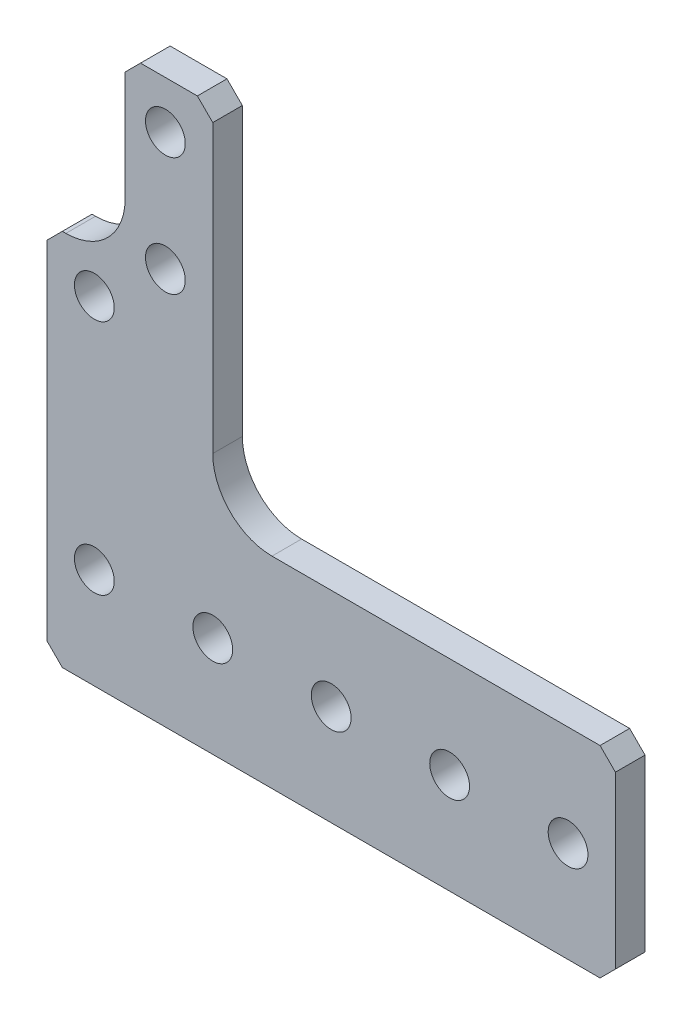
ISO-10303-21;
HEADER;
FILE_DESCRIPTION(('STEP AP214'),'2;1');
FILE_NAME('part.step','',(''),(''),'','','');
FILE_SCHEMA(('AUTOMOTIVE_DESIGN { 1 0 10303 214 1 1 1 1 }'));
ENDSEC;
DATA;
#1=APPLICATION_CONTEXT('core data for automotive mechanical design processes');
#2=APPLICATION_PROTOCOL_DEFINITION('international standard','automotive_design',2000,#1);
#3=PRODUCT_CONTEXT('',#1,'mechanical');
#4=PRODUCT('Part','Part','',(#3));
#5=PRODUCT_RELATED_PRODUCT_CATEGORY('part','',(#4));
#6=PRODUCT_DEFINITION_FORMATION('','',#4);
#7=PRODUCT_DEFINITION_CONTEXT('part definition',#1,'design');
#8=PRODUCT_DEFINITION('design','',#6,#7);
#9=PRODUCT_DEFINITION_SHAPE('','',#8);
#10=(LENGTH_UNIT() NAMED_UNIT(*) SI_UNIT(.MILLI.,.METRE.));
#11=(NAMED_UNIT(*) PLANE_ANGLE_UNIT() SI_UNIT($,.RADIAN.));
#12=(NAMED_UNIT(*) SI_UNIT($,.STERADIAN.) SOLID_ANGLE_UNIT());
#13=UNCERTAINTY_MEASURE_WITH_UNIT(LENGTH_MEASURE(1.E-05),#10,'distance_accuracy_value','');
#14=(GEOMETRIC_REPRESENTATION_CONTEXT(3) GLOBAL_UNCERTAINTY_ASSIGNED_CONTEXT((#13)) GLOBAL_UNIT_ASSIGNED_CONTEXT((#10,
#11,#12)) REPRESENTATION_CONTEXT('',''));
#15=CARTESIAN_POINT('',(0.,0.,0.));
#16=DIRECTION('',(0.,0.,1.));
#17=DIRECTION('',(1.,0.,0.));
#18=AXIS2_PLACEMENT_3D('',#15,#16,#17);
#19=CARTESIAN_POINT('',(-5.08,29.718,3.175));
#20=DIRECTION('',(0.,-1.,0.));
#21=DIRECTION('',(1.,0.,0.));
#22=AXIS2_PLACEMENT_3D('',#19,#20,#21);
#23=PLANE('',#22);
#24=DIRECTION('',(0.,0.,1.));
#25=VECTOR('',#24,1.);
#26=CARTESIAN_POINT('',(-3.42899999999999,29.718,3.175));
#27=LINE('',#26,#25);
#28=CARTESIAN_POINT('',(-3.42899999999999,29.718,0.));
#29=VERTEX_POINT('',#28);
#30=CARTESIAN_POINT('',(-3.42899999999999,29.718,3.175));
#31=VERTEX_POINT('',#30);
#32=EDGE_CURVE('E158',#29,#31,#27,.T.);
#33=ORIENTED_EDGE('',*,*,#32,.T.);
#34=DIRECTION('',(1.,0.,0.));
#35=VECTOR('',#34,1.);
#36=CARTESIAN_POINT('',(-5.08,29.718,3.175));
#37=LINE('',#36,#35);
#38=CARTESIAN_POINT('',(-3.04800000000001,29.718,3.175));
#39=VERTEX_POINT('',#38);
#40=EDGE_CURVE('E161',#39,#31,#37,.F.);
#41=ORIENTED_EDGE('',*,*,#40,.F.);
#42=DIRECTION('',(0.,0.,1.));
#43=VECTOR('',#42,1.);
#44=CARTESIAN_POINT('',(-3.04800000000001,29.718,3.175));
#45=LINE('',#44,#43);
#46=CARTESIAN_POINT('',(-3.048,29.718,0.));
#47=VERTEX_POINT('',#46);
#48=EDGE_CURVE('E140',#39,#47,#45,.F.);
#49=ORIENTED_EDGE('',*,*,#48,.T.);
#50=DIRECTION('',(-1.,0.,0.));
#51=VECTOR('',#50,1.);
#52=CARTESIAN_POINT('',(0.,29.718,0.));
#53=LINE('',#52,#51);
#54=EDGE_CURVE('E128',#29,#47,#53,.F.);
#55=ORIENTED_EDGE('',*,*,#54,.F.);
#56=EDGE_LOOP('',(#33,#41,#49,#55));
#57=FACE_BOUND('',#56,.T.);
#58=ADVANCED_FACE('F17',(#57),#23,.F.);
#59=CARTESIAN_POINT('',(0.,0.,0.));
#60=DIRECTION('',(0.,0.,-1.));
#61=DIRECTION('',(-1.,0.,0.));
#62=AXIS2_PLACEMENT_3D('',#59,#60,#61);
#63=PLANE('',#62);
#64=CARTESIAN_POINT('',(50.8,0.,0.));
#65=DIRECTION('',(0.,0.,-1.));
#66=DIRECTION('',(-1.,0.,0.));
#67=AXIS2_PLACEMENT_3D('',#64,#65,#66);
#68=CIRCLE('',#67,2.1336);
#69=CARTESIAN_POINT('',(48.6664,0.,0.));
#70=VERTEX_POINT('',#69);
#71=EDGE_CURVE('E210',#70,#70,#68,.F.);
#72=ORIENTED_EDGE('',*,*,#71,.T.);
#73=EDGE_LOOP('',(#72));
#74=FACE_BOUND('',#73,.T.);
#75=CARTESIAN_POINT('',(25.4,0.,0.));
#76=DIRECTION('',(0.,0.,-1.));
#77=DIRECTION('',(-1.,0.,0.));
#78=AXIS2_PLACEMENT_3D('',#75,#76,#77);
#79=CIRCLE('',#78,2.1336);
#80=CARTESIAN_POINT('',(23.2664,0.,0.));
#81=VERTEX_POINT('',#80);
#82=EDGE_CURVE('E246',#81,#81,#79,.F.);
#83=ORIENTED_EDGE('',*,*,#82,.T.);
#84=EDGE_LOOP('',(#83));
#85=FACE_BOUND('',#84,.T.);
#86=CARTESIAN_POINT('',(7.62,44.45,0.));
#87=DIRECTION('',(0.,0.,-1.));
#88=DIRECTION('',(-1.,0.,0.));
#89=AXIS2_PLACEMENT_3D('',#86,#87,#88);
#90=CIRCLE('',#89,2.1336);
#91=CARTESIAN_POINT('',(5.48639999999999,44.45,0.));
#92=VERTEX_POINT('',#91);
#93=EDGE_CURVE('E252',#92,#92,#90,.F.);
#94=ORIENTED_EDGE('',*,*,#93,.T.);
#95=EDGE_LOOP('',(#94));
#96=FACE_BOUND('',#95,.T.);
#97=CARTESIAN_POINT('',(0.,25.4,0.));
#98=DIRECTION('',(0.,0.,-1.));
#99=DIRECTION('',(-1.,0.,0.));
#100=AXIS2_PLACEMENT_3D('',#97,#98,#99);
#101=CIRCLE('',#100,2.1336);
#102=CARTESIAN_POINT('',(-2.1336,25.4,0.));
#103=VERTEX_POINT('',#102);
#104=EDGE_CURVE('E258',#103,#103,#101,.F.);
#105=ORIENTED_EDGE('',*,*,#104,.T.);
#106=EDGE_LOOP('',(#105));
#107=FACE_BOUND('',#106,.T.);
#108=DIRECTION('',(0.,1.,0.));
#109=VECTOR('',#108,1.);
#110=CARTESIAN_POINT('',(55.88,-10.795,0.));
#111=LINE('',#110,#109);
#112=CARTESIAN_POINT('',(55.88,9.144,0.));
#113=VERTEX_POINT('',#112);
#114=CARTESIAN_POINT('',(55.88,-9.144,0.));
#115=VERTEX_POINT('',#114);
#116=EDGE_CURVE('E334',#113,#115,#111,.F.);
#117=ORIENTED_EDGE('',*,*,#116,.T.);
#118=DIRECTION('',(-0.707106781186548,-0.707106781186548,0.));
#119=VECTOR('',#118,1.);
#120=CARTESIAN_POINT('',(55.88,-9.144,0.));
#121=LINE('',#120,#119);
#122=CARTESIAN_POINT('',(54.229,-10.795,0.));
#123=VERTEX_POINT('',#122);
#124=EDGE_CURVE('E329',#115,#123,#121,.T.);
#125=ORIENTED_EDGE('',*,*,#124,.T.);
#126=DIRECTION('',(1.,0.,0.));
#127=VECTOR('',#126,1.);
#128=CARTESIAN_POINT('',(-5.08,-10.795,0.));
#129=LINE('',#128,#127);
#130=CARTESIAN_POINT('',(-3.429,-10.795,0.));
#131=VERTEX_POINT('',#130);
#132=EDGE_CURVE('E324',#123,#131,#129,.F.);
#133=ORIENTED_EDGE('',*,*,#132,.T.);
#134=DIRECTION('',(-0.707106781186546,0.707106781186549,0.));
#135=VECTOR('',#134,1.);
#136=CARTESIAN_POINT('',(-3.429,-10.795,0.));
#137=LINE('',#136,#135);
#138=CARTESIAN_POINT('',(-5.08,-9.14399999999999,0.));
#139=VERTEX_POINT('',#138);
#140=EDGE_CURVE('E319',#131,#139,#137,.T.);
#141=ORIENTED_EDGE('',*,*,#140,.T.);
#142=DIRECTION('',(0.,1.,0.));
#143=VECTOR('',#142,1.);
#144=CARTESIAN_POINT('',(-5.08,-10.795,0.));
#145=LINE('',#144,#143);
#146=CARTESIAN_POINT('',(-5.08,28.067,0.));
#147=VERTEX_POINT('',#146);
#148=EDGE_CURVE('E263',#139,#147,#145,.T.);
#149=ORIENTED_EDGE('',*,*,#148,.T.);
#150=DIRECTION('',(0.707106781186549,0.707106781186546,0.));
#151=VECTOR('',#150,1.);
#152=CARTESIAN_POINT('',(-5.08,28.067,0.));
#153=LINE('',#152,#151);
#154=EDGE_CURVE('E160',#147,#29,#153,.T.);
#155=ORIENTED_EDGE('',*,*,#154,.T.);
#156=ORIENTED_EDGE('',*,*,#54,.T.);
#157=CARTESIAN_POINT('',(-3.048,36.068,0.));
#158=DIRECTION('',(0.,0.,1.));
#159=DIRECTION('',(1.,0.,0.));
#160=AXIS2_PLACEMENT_3D('',#157,#158,#159);
#161=CIRCLE('',#160,6.35);
#162=CARTESIAN_POINT('',(3.302,36.068,0.));
#163=VERTEX_POINT('',#162);
#164=EDGE_CURVE('E20',#47,#163,#161,.T.);
#165=ORIENTED_EDGE('',*,*,#164,.T.);
#166=DIRECTION('',(0.,1.,0.));
#167=VECTOR('',#166,1.);
#168=CARTESIAN_POINT('',(3.302,29.718,0.));
#169=LINE('',#168,#167);
#170=CARTESIAN_POINT('',(3.302,47.879,0.));
#171=VERTEX_POINT('',#170);
#172=EDGE_CURVE('E133',#163,#171,#169,.T.);
#173=ORIENTED_EDGE('',*,*,#172,.T.);
#174=DIRECTION('',(0.707106781186549,0.707106781186546,0.));
#175=VECTOR('',#174,1.);
#176=CARTESIAN_POINT('',(3.302,47.879,0.));
#177=LINE('',#176,#175);
#178=CARTESIAN_POINT('',(4.953,49.53,0.));
#179=VERTEX_POINT('',#178);
#180=EDGE_CURVE('E191',#171,#179,#177,.T.);
#181=ORIENTED_EDGE('',*,*,#180,.T.);
#182=DIRECTION('',(1.,0.,0.));
#183=VECTOR('',#182,1.);
#184=CARTESIAN_POINT('',(3.302,49.53,0.));
#185=LINE('',#184,#183);
#186=CARTESIAN_POINT('',(11.049,49.53,0.));
#187=VERTEX_POINT('',#186);
#188=EDGE_CURVE('E186',#179,#187,#185,.T.);
#189=ORIENTED_EDGE('',*,*,#188,.T.);
#190=DIRECTION('',(0.707106781186548,-0.707106781186548,0.));
#191=VECTOR('',#190,1.);
#192=CARTESIAN_POINT('',(11.049,49.53,0.));
#193=LINE('',#192,#191);
#194=CARTESIAN_POINT('',(12.7,47.879,0.));
#195=VERTEX_POINT('',#194);
#196=EDGE_CURVE('E181',#187,#195,#193,.T.);
#197=ORIENTED_EDGE('',*,*,#196,.T.);
#198=DIRECTION('',(0.,-1.,0.));
#199=VECTOR('',#198,1.);
#200=CARTESIAN_POINT('',(12.7,49.53,0.));
#201=LINE('',#200,#199);
#202=CARTESIAN_POINT('',(12.7,17.145,0.));
#203=VERTEX_POINT('',#202);
#204=EDGE_CURVE('E175',#195,#203,#201,.T.);
#205=ORIENTED_EDGE('',*,*,#204,.T.);
#206=CARTESIAN_POINT('',(19.05,17.145,0.));
#207=DIRECTION('',(0.,0.,1.));
#208=DIRECTION('',(1.,0.,0.));
#209=AXIS2_PLACEMENT_3D('',#206,#207,#208);
#210=CIRCLE('',#209,6.35);
#211=CARTESIAN_POINT('',(19.05,10.795,0.));
#212=VERTEX_POINT('',#211);
#213=EDGE_CURVE('E264',#203,#212,#210,.T.);
#214=ORIENTED_EDGE('',*,*,#213,.T.);
#215=DIRECTION('',(1.,0.,0.));
#216=VECTOR('',#215,1.);
#217=CARTESIAN_POINT('',(12.7,10.795,0.));
#218=LINE('',#217,#216);
#219=CARTESIAN_POINT('',(54.229,10.795,0.));
#220=VERTEX_POINT('',#219);
#221=EDGE_CURVE('E164',#212,#220,#218,.T.);
#222=ORIENTED_EDGE('',*,*,#221,.T.);
#223=DIRECTION('',(0.707106781186546,-0.707106781186549,0.));
#224=VECTOR('',#223,1.);
#225=CARTESIAN_POINT('',(54.229,10.795,0.));
#226=LINE('',#225,#224);
#227=EDGE_CURVE('E170',#220,#113,#226,.T.);
#228=ORIENTED_EDGE('',*,*,#227,.T.);
#229=EDGE_LOOP('',(#117,#125,#133,#141,#149,#155,#156,#165,#173,#181,#189,#197,#205,#214,#222,#228));
#230=FACE_BOUND('',#229,.T.);
#231=CARTESIAN_POINT('',(0.,0.,0.));
#232=DIRECTION('',(0.,0.,-1.));
#233=DIRECTION('',(-1.,0.,0.));
#234=AXIS2_PLACEMENT_3D('',#231,#232,#233);
#235=CIRCLE('',#234,2.1336);
#236=CARTESIAN_POINT('',(-2.1336,0.,0.));
#237=VERTEX_POINT('',#236);
#238=EDGE_CURVE('E261',#237,#237,#235,.F.);
#239=ORIENTED_EDGE('',*,*,#238,.T.);
#240=EDGE_LOOP('',(#239));
#241=FACE_BOUND('',#240,.T.);
#242=CARTESIAN_POINT('',(7.62,31.75,0.));
#243=DIRECTION('',(0.,0.,-1.));
#244=DIRECTION('',(-1.,0.,0.));
#245=AXIS2_PLACEMENT_3D('',#242,#243,#244);
#246=CIRCLE('',#245,2.1336);
#247=CARTESIAN_POINT('',(5.4864,31.75,0.));
#248=VERTEX_POINT('',#247);
#249=EDGE_CURVE('E255',#248,#248,#246,.F.);
#250=ORIENTED_EDGE('',*,*,#249,.T.);
#251=EDGE_LOOP('',(#250));
#252=FACE_BOUND('',#251,.T.);
#253=CARTESIAN_POINT('',(12.7,0.,0.));
#254=DIRECTION('',(0.,0.,-1.));
#255=DIRECTION('',(-1.,0.,0.));
#256=AXIS2_PLACEMENT_3D('',#253,#254,#255);
#257=CIRCLE('',#256,2.1336);
#258=CARTESIAN_POINT('',(10.5664,0.,0.));
#259=VERTEX_POINT('',#258);
#260=EDGE_CURVE('E249',#259,#259,#257,.F.);
#261=ORIENTED_EDGE('',*,*,#260,.T.);
#262=EDGE_LOOP('',(#261));
#263=FACE_BOUND('',#262,.T.);
#264=CARTESIAN_POINT('',(38.1,0.,0.));
#265=DIRECTION('',(0.,0.,-1.));
#266=DIRECTION('',(-1.,0.,0.));
#267=AXIS2_PLACEMENT_3D('',#264,#265,#266);
#268=CIRCLE('',#267,2.1336);
#269=CARTESIAN_POINT('',(35.9664,0.,0.));
#270=VERTEX_POINT('',#269);
#271=EDGE_CURVE('E243',#270,#270,#268,.F.);
#272=ORIENTED_EDGE('',*,*,#271,.T.);
#273=EDGE_LOOP('',(#272));
#274=FACE_BOUND('',#273,.T.);
#275=ADVANCED_FACE('F131',(#74,#85,#96,#107,#230,#241,#252,#263,#274),#63,.T.);
#276=CARTESIAN_POINT('',(-5.08,28.067,3.175));
#277=DIRECTION('',(0.707106781186546,-0.707106781186549,0.));
#278=DIRECTION('',(0.707106781186549,0.707106781186546,0.));
#279=AXIS2_PLACEMENT_3D('',#276,#277,#278);
#280=PLANE('',#279);
#281=ORIENTED_EDGE('',*,*,#32,.F.);
#282=ORIENTED_EDGE('',*,*,#154,.F.);
#283=DIRECTION('',(0.,0.,1.));
#284=VECTOR('',#283,1.);
#285=CARTESIAN_POINT('',(-5.08,28.067,3.175));
#286=LINE('',#285,#284);
#287=CARTESIAN_POINT('',(-5.08,28.067,3.175));
#288=VERTEX_POINT('',#287);
#289=EDGE_CURVE('E316',#147,#288,#286,.T.);
#290=ORIENTED_EDGE('',*,*,#289,.T.);
#291=DIRECTION('',(0.70710678118655,0.707106781186545,0.));
#292=VECTOR('',#291,1.);
#293=CARTESIAN_POINT('',(-5.08,28.067,3.175));
#294=LINE('',#293,#292);
#295=EDGE_CURVE('E207',#288,#31,#294,.T.);
#296=ORIENTED_EDGE('',*,*,#295,.T.);
#297=EDGE_LOOP('',(#281,#282,#290,#296));
#298=FACE_BOUND('',#297,.T.);
#299=ADVANCED_FACE('F383',(#298),#280,.F.);
#300=CARTESIAN_POINT('',(-3.048,36.068,3.175));
#301=DIRECTION('',(0.,0.,1.));
#302=DIRECTION('',(1.,0.,0.));
#303=AXIS2_PLACEMENT_3D('',#300,#301,#302);
#304=CYLINDRICAL_SURFACE('',#303,6.35);
#305=DIRECTION('',(0.,0.,-1.));
#306=VECTOR('',#305,1.);
#307=CARTESIAN_POINT('',(3.302,36.068,3.175));
#308=LINE('',#307,#306);
#309=CARTESIAN_POINT('',(3.302,36.068,3.175));
#310=VERTEX_POINT('',#309);
#311=EDGE_CURVE('E139',#310,#163,#308,.T.);
#312=ORIENTED_EDGE('',*,*,#311,.T.);
#313=ORIENTED_EDGE('',*,*,#164,.F.);
#314=ORIENTED_EDGE('',*,*,#48,.F.);
#315=CARTESIAN_POINT('',(-3.048,36.068,3.175));
#316=DIRECTION('',(0.,0.,1.));
#317=DIRECTION('',(1.,0.,0.));
#318=AXIS2_PLACEMENT_3D('',#315,#316,#317);
#319=CIRCLE('',#318,6.35);
#320=EDGE_CURVE('E151',#39,#310,#319,.T.);
#321=ORIENTED_EDGE('',*,*,#320,.T.);
#322=EDGE_LOOP('',(#312,#313,#314,#321));
#323=FACE_BOUND('',#322,.T.);
#324=ADVANCED_FACE('F149',(#323),#304,.F.);
#325=CARTESIAN_POINT('',(3.302,29.718,3.175));
#326=DIRECTION('',(1.,0.,0.));
#327=DIRECTION('',(0.,0.,-1.));
#328=AXIS2_PLACEMENT_3D('',#325,#326,#327);
#329=PLANE('',#328);
#330=DIRECTION('',(0.,0.,1.));
#331=VECTOR('',#330,1.);
#332=CARTESIAN_POINT('',(3.302,47.879,3.175));
#333=LINE('',#332,#331);
#334=CARTESIAN_POINT('',(3.302,47.879,3.175));
#335=VERTEX_POINT('',#334);
#336=EDGE_CURVE('E146',#335,#171,#333,.F.);
#337=ORIENTED_EDGE('',*,*,#336,.T.);
#338=ORIENTED_EDGE('',*,*,#172,.F.);
#339=ORIENTED_EDGE('',*,*,#311,.F.);
#340=DIRECTION('',(0.,1.,0.));
#341=VECTOR('',#340,1.);
#342=CARTESIAN_POINT('',(3.302,0.,3.175));
#343=LINE('',#342,#341);
#344=EDGE_CURVE('E240',#310,#335,#343,.T.);
#345=ORIENTED_EDGE('',*,*,#344,.T.);
#346=EDGE_LOOP('',(#337,#338,#339,#345));
#347=FACE_BOUND('',#346,.T.);
#348=ADVANCED_FACE('F143',(#347),#329,.F.);
#349=CARTESIAN_POINT('',(3.302,47.879,3.175));
#350=DIRECTION('',(0.707106781186546,-0.707106781186549,0.));
#351=DIRECTION('',(0.707106781186549,0.707106781186546,0.));
#352=AXIS2_PLACEMENT_3D('',#349,#350,#351);
#353=PLANE('',#352);
#354=DIRECTION('',(0.,0.,-1.));
#355=VECTOR('',#354,1.);
#356=CARTESIAN_POINT('',(4.953,49.53,3.175));
#357=LINE('',#356,#355);
#358=CARTESIAN_POINT('',(4.953,49.53,3.175));
#359=VERTEX_POINT('',#358);
#360=EDGE_CURVE('E188',#359,#179,#357,.T.);
#361=ORIENTED_EDGE('',*,*,#360,.T.);
#362=ORIENTED_EDGE('',*,*,#180,.F.);
#363=ORIENTED_EDGE('',*,*,#336,.F.);
#364=DIRECTION('',(0.707106781186547,0.707106781186547,0.));
#365=VECTOR('',#364,1.);
#366=CARTESIAN_POINT('',(3.302,47.879,3.175));
#367=LINE('',#366,#365);
#368=EDGE_CURVE('E294',#335,#359,#367,.T.);
#369=ORIENTED_EDGE('',*,*,#368,.T.);
#370=EDGE_LOOP('',(#361,#362,#363,#369));
#371=FACE_BOUND('',#370,.T.);
#372=ADVANCED_FACE('F492',(#371),#353,.F.);
#373=CARTESIAN_POINT('',(3.302,49.53,3.175));
#374=DIRECTION('',(0.,-1.,0.));
#375=DIRECTION('',(0.,0.,-1.));
#376=AXIS2_PLACEMENT_3D('',#373,#374,#375);
#377=PLANE('',#376);
#378=DIRECTION('',(0.,0.,1.));
#379=VECTOR('',#378,1.);
#380=CARTESIAN_POINT('',(11.049,49.53,3.175));
#381=LINE('',#380,#379);
#382=CARTESIAN_POINT('',(11.049,49.53,3.175));
#383=VERTEX_POINT('',#382);
#384=EDGE_CURVE('E183',#383,#187,#381,.F.);
#385=ORIENTED_EDGE('',*,*,#384,.T.);
#386=ORIENTED_EDGE('',*,*,#188,.F.);
#387=ORIENTED_EDGE('',*,*,#360,.F.);
#388=DIRECTION('',(-1.,0.,0.));
#389=VECTOR('',#388,1.);
#390=CARTESIAN_POINT('',(0.,49.53,3.175));
#391=LINE('',#390,#389);
#392=EDGE_CURVE('E285',#359,#383,#391,.F.);
#393=ORIENTED_EDGE('',*,*,#392,.T.);
#394=EDGE_LOOP('',(#385,#386,#387,#393));
#395=FACE_BOUND('',#394,.T.);
#396=ADVANCED_FACE('F379',(#395),#377,.F.);
#397=CARTESIAN_POINT('',(11.049,49.53,3.175));
#398=DIRECTION('',(-0.707106781186548,-0.707106781186548,0.));
#399=DIRECTION('',(0.707106781186548,-0.707106781186548,0.));
#400=AXIS2_PLACEMENT_3D('',#397,#398,#399);
#401=PLANE('',#400);
#402=DIRECTION('',(0.,0.,1.));
#403=VECTOR('',#402,1.);
#404=CARTESIAN_POINT('',(12.7,47.879,3.175));
#405=LINE('',#404,#403);
#406=CARTESIAN_POINT('',(12.7,47.879,3.175));
#407=VERTEX_POINT('',#406);
#408=EDGE_CURVE('E178',#407,#195,#405,.F.);
#409=ORIENTED_EDGE('',*,*,#408,.T.);
#410=ORIENTED_EDGE('',*,*,#196,.F.);
#411=ORIENTED_EDGE('',*,*,#384,.F.);
#412=DIRECTION('',(0.707106781186547,-0.707106781186547,0.));
#413=VECTOR('',#412,1.);
#414=CARTESIAN_POINT('',(11.049,49.53,3.175));
#415=LINE('',#414,#413);
#416=EDGE_CURVE('E282',#383,#407,#415,.T.);
#417=ORIENTED_EDGE('',*,*,#416,.T.);
#418=EDGE_LOOP('',(#409,#410,#411,#417));
#419=FACE_BOUND('',#418,.T.);
#420=ADVANCED_FACE('F375',(#419),#401,.F.);
#421=CARTESIAN_POINT('',(12.7,49.53,3.175));
#422=DIRECTION('',(-1.,0.,0.));
#423=DIRECTION('',(0.,-1.,0.));
#424=AXIS2_PLACEMENT_3D('',#421,#422,#423);
#425=PLANE('',#424);
#426=ORIENTED_EDGE('',*,*,#408,.F.);
#427=DIRECTION('',(0.,1.,0.));
#428=VECTOR('',#427,1.);
#429=CARTESIAN_POINT('',(12.7,0.,3.175));
#430=LINE('',#429,#428);
#431=CARTESIAN_POINT('',(12.7,17.145,3.175));
#432=VERTEX_POINT('',#431);
#433=EDGE_CURVE('E238',#407,#432,#430,.F.);
#434=ORIENTED_EDGE('',*,*,#433,.T.);
#435=DIRECTION('',(0.,0.,1.));
#436=VECTOR('',#435,1.);
#437=CARTESIAN_POINT('',(12.7,17.145,3.175));
#438=LINE('',#437,#436);
#439=EDGE_CURVE('E177',#432,#203,#438,.F.);
#440=ORIENTED_EDGE('',*,*,#439,.T.);
#441=ORIENTED_EDGE('',*,*,#204,.F.);
#442=EDGE_LOOP('',(#426,#434,#440,#441));
#443=FACE_BOUND('',#442,.T.);
#444=ADVANCED_FACE('F371',(#443),#425,.F.);
#445=CARTESIAN_POINT('',(19.05,17.145,3.175));
#446=DIRECTION('',(0.,0.,1.));
#447=DIRECTION('',(1.,0.,0.));
#448=AXIS2_PLACEMENT_3D('',#445,#446,#447);
#449=CYLINDRICAL_SURFACE('',#448,6.35);
#450=DIRECTION('',(0.,0.,-1.));
#451=VECTOR('',#450,1.);
#452=CARTESIAN_POINT('',(19.05,10.795,3.175));
#453=LINE('',#452,#451);
#454=CARTESIAN_POINT('',(19.05,10.795,3.175));
#455=VERTEX_POINT('',#454);
#456=EDGE_CURVE('E167',#455,#212,#453,.T.);
#457=ORIENTED_EDGE('',*,*,#456,.T.);
#458=ORIENTED_EDGE('',*,*,#213,.F.);
#459=ORIENTED_EDGE('',*,*,#439,.F.);
#460=CARTESIAN_POINT('',(19.05,17.145,3.175));
#461=DIRECTION('',(0.,0.,1.));
#462=DIRECTION('',(1.,0.,0.));
#463=AXIS2_PLACEMENT_3D('',#460,#461,#462);
#464=CIRCLE('',#463,6.35);
#465=EDGE_CURVE('E234',#432,#455,#464,.T.);
#466=ORIENTED_EDGE('',*,*,#465,.T.);
#467=EDGE_LOOP('',(#457,#458,#459,#466));
#468=FACE_BOUND('',#467,.T.);
#469=ADVANCED_FACE('F501',(#468),#449,.F.);
#470=CARTESIAN_POINT('',(12.7,10.795,3.175));
#471=DIRECTION('',(0.,-1.,0.));
#472=DIRECTION('',(0.,0.,-1.));
#473=AXIS2_PLACEMENT_3D('',#470,#471,#472);
#474=PLANE('',#473);
#475=DIRECTION('',(0.,0.,1.));
#476=VECTOR('',#475,1.);
#477=CARTESIAN_POINT('',(54.229,10.795,3.175));
#478=LINE('',#477,#476);
#479=CARTESIAN_POINT('',(54.229,10.795,3.175));
#480=VERTEX_POINT('',#479);
#481=EDGE_CURVE('E166',#480,#220,#478,.F.);
#482=ORIENTED_EDGE('',*,*,#481,.T.);
#483=ORIENTED_EDGE('',*,*,#221,.F.);
#484=ORIENTED_EDGE('',*,*,#456,.F.);
#485=DIRECTION('',(-1.,0.,0.));
#486=VECTOR('',#485,1.);
#487=CARTESIAN_POINT('',(0.,10.795,3.175));
#488=LINE('',#487,#486);
#489=EDGE_CURVE('E237',#455,#480,#488,.F.);
#490=ORIENTED_EDGE('',*,*,#489,.T.);
#491=EDGE_LOOP('',(#482,#483,#484,#490));
#492=FACE_BOUND('',#491,.T.);
#493=ADVANCED_FACE('F346',(#492),#474,.F.);
#494=CARTESIAN_POINT('',(54.229,10.795,3.175));
#495=DIRECTION('',(-0.707106781186549,-0.707106781186546,0.));
#496=DIRECTION('',(0.707106781186546,-0.707106781186549,0.));
#497=AXIS2_PLACEMENT_3D('',#494,#495,#496);
#498=PLANE('',#497);
#499=DIRECTION('',(0.,0.,1.));
#500=VECTOR('',#499,1.);
#501=CARTESIAN_POINT('',(55.88,9.14399999999999,3.175));
#502=LINE('',#501,#500);
#503=CARTESIAN_POINT('',(55.88,9.144,3.175));
#504=VERTEX_POINT('',#503);
#505=EDGE_CURVE('E172',#504,#113,#502,.F.);
#506=ORIENTED_EDGE('',*,*,#505,.T.);
#507=ORIENTED_EDGE('',*,*,#227,.F.);
#508=ORIENTED_EDGE('',*,*,#481,.F.);
#509=DIRECTION('',(0.707106781186544,-0.70710678118655,0.));
#510=VECTOR('',#509,1.);
#511=CARTESIAN_POINT('',(54.229,10.795,3.175));
#512=LINE('',#511,#510);
#513=EDGE_CURVE('E338',#480,#504,#512,.T.);
#514=ORIENTED_EDGE('',*,*,#513,.T.);
#515=EDGE_LOOP('',(#506,#507,#508,#514));
#516=FACE_BOUND('',#515,.T.);
#517=ADVANCED_FACE('F351',(#516),#498,.F.);
#518=CARTESIAN_POINT('',(55.88,-10.795,3.175));
#519=DIRECTION('',(-1.,0.,0.));
#520=DIRECTION('',(0.,0.,1.));
#521=AXIS2_PLACEMENT_3D('',#518,#519,#520);
#522=PLANE('',#521);
#523=DIRECTION('',(0.,0.,1.));
#524=VECTOR('',#523,1.);
#525=CARTESIAN_POINT('',(55.88,-9.144,3.175));
#526=LINE('',#525,#524);
#527=CARTESIAN_POINT('',(55.88,-9.144,3.175));
#528=VERTEX_POINT('',#527);
#529=EDGE_CURVE('E331',#528,#115,#526,.F.);
#530=ORIENTED_EDGE('',*,*,#529,.T.);
#531=ORIENTED_EDGE('',*,*,#116,.F.);
#532=ORIENTED_EDGE('',*,*,#505,.F.);
#533=DIRECTION('',(0.,1.,0.));
#534=VECTOR('',#533,1.);
#535=CARTESIAN_POINT('',(55.88,0.,3.175));
#536=LINE('',#535,#534);
#537=EDGE_CURVE('E341',#504,#528,#536,.F.);
#538=ORIENTED_EDGE('',*,*,#537,.T.);
#539=EDGE_LOOP('',(#530,#531,#532,#538));
#540=FACE_BOUND('',#539,.T.);
#541=ADVANCED_FACE('F398',(#540),#522,.F.);
#542=CARTESIAN_POINT('',(55.88,-9.144,3.175));
#543=DIRECTION('',(-0.707106781186548,0.707106781186548,0.));
#544=DIRECTION('',(-0.707106781186548,-0.707106781186548,0.));
#545=AXIS2_PLACEMENT_3D('',#542,#543,#544);
#546=PLANE('',#545);
#547=DIRECTION('',(0.,0.,1.));
#548=VECTOR('',#547,1.);
#549=CARTESIAN_POINT('',(54.229,-10.795,3.175));
#550=LINE('',#549,#548);
#551=CARTESIAN_POINT('',(54.229,-10.795,3.175));
#552=VERTEX_POINT('',#551);
#553=EDGE_CURVE('E326',#552,#123,#550,.F.);
#554=ORIENTED_EDGE('',*,*,#553,.T.);
#555=ORIENTED_EDGE('',*,*,#124,.F.);
#556=ORIENTED_EDGE('',*,*,#529,.F.);
#557=DIRECTION('',(-0.707106781186546,-0.707106781186549,0.));
#558=VECTOR('',#557,1.);
#559=CARTESIAN_POINT('',(55.88,-9.144,3.175));
#560=LINE('',#559,#558);
#561=EDGE_CURVE('E361',#528,#552,#560,.T.);
#562=ORIENTED_EDGE('',*,*,#561,.T.);
#563=EDGE_LOOP('',(#554,#555,#556,#562));
#564=FACE_BOUND('',#563,.T.);
#565=ADVANCED_FACE('F395',(#564),#546,.F.);
#566=CARTESIAN_POINT('',(-5.08,-10.795,3.175));
#567=DIRECTION('',(0.,1.,0.));
#568=DIRECTION('',(0.,0.,1.));
#569=AXIS2_PLACEMENT_3D('',#566,#567,#568);
#570=PLANE('',#569);
#571=DIRECTION('',(0.,0.,1.));
#572=VECTOR('',#571,1.);
#573=CARTESIAN_POINT('',(-3.429,-10.795,3.175));
#574=LINE('',#573,#572);
#575=CARTESIAN_POINT('',(-3.429,-10.795,3.175));
#576=VERTEX_POINT('',#575);
#577=EDGE_CURVE('E321',#576,#131,#574,.F.);
#578=ORIENTED_EDGE('',*,*,#577,.T.);
#579=ORIENTED_EDGE('',*,*,#132,.F.);
#580=ORIENTED_EDGE('',*,*,#553,.F.);
#581=DIRECTION('',(-1.,0.,0.));
#582=VECTOR('',#581,1.);
#583=CARTESIAN_POINT('',(0.,-10.795,3.175));
#584=LINE('',#583,#582);
#585=EDGE_CURVE('E364',#552,#576,#584,.T.);
#586=ORIENTED_EDGE('',*,*,#585,.T.);
#587=EDGE_LOOP('',(#578,#579,#580,#586));
#588=FACE_BOUND('',#587,.T.);
#589=ADVANCED_FACE('F392',(#588),#570,.F.);
#590=CARTESIAN_POINT('',(-3.429,-10.795,3.175));
#591=DIRECTION('',(0.707106781186549,0.707106781186546,0.));
#592=DIRECTION('',(-0.707106781186546,0.707106781186549,0.));
#593=AXIS2_PLACEMENT_3D('',#590,#591,#592);
#594=PLANE('',#593);
#595=DIRECTION('',(0.,0.,1.));
#596=VECTOR('',#595,1.);
#597=CARTESIAN_POINT('',(-5.08,-9.14399999999999,3.175));
#598=LINE('',#597,#596);
#599=CARTESIAN_POINT('',(-5.08,-9.14399999999999,3.175));
#600=VERTEX_POINT('',#599);
#601=EDGE_CURVE('E35',#600,#139,#598,.F.);
#602=ORIENTED_EDGE('',*,*,#601,.T.);
#603=ORIENTED_EDGE('',*,*,#140,.F.);
#604=ORIENTED_EDGE('',*,*,#577,.F.);
#605=DIRECTION('',(-0.707106781186546,0.707106781186549,0.));
#606=VECTOR('',#605,1.);
#607=CARTESIAN_POINT('',(-3.429,-10.795,3.175));
#608=LINE('',#607,#606);
#609=EDGE_CURVE('E387',#576,#600,#608,.T.);
#610=ORIENTED_EDGE('',*,*,#609,.T.);
#611=EDGE_LOOP('',(#602,#603,#604,#610));
#612=FACE_BOUND('',#611,.T.);
#613=ADVANCED_FACE('F401',(#612),#594,.F.);
#614=CARTESIAN_POINT('',(-5.08,-10.795,3.175));
#615=DIRECTION('',(1.,0.,0.));
#616=DIRECTION('',(0.,1.,0.));
#617=AXIS2_PLACEMENT_3D('',#614,#615,#616);
#618=PLANE('',#617);
#619=ORIENTED_EDGE('',*,*,#601,.F.);
#620=DIRECTION('',(0.,1.,0.));
#621=VECTOR('',#620,1.);
#622=CARTESIAN_POINT('',(-5.08,0.,3.175));
#623=LINE('',#622,#621);
#624=EDGE_CURVE('E233',#600,#288,#623,.T.);
#625=ORIENTED_EDGE('',*,*,#624,.T.);
#626=ORIENTED_EDGE('',*,*,#289,.F.);
#627=ORIENTED_EDGE('',*,*,#148,.F.);
#628=EDGE_LOOP('',(#619,#625,#626,#627));
#629=FACE_BOUND('',#628,.T.);
#630=ADVANCED_FACE('F385',(#629),#618,.F.);
#631=CARTESIAN_POINT('',(0.,0.,3.175));
#632=DIRECTION('',(0.,0.,-1.));
#633=DIRECTION('',(-1.,0.,0.));
#634=AXIS2_PLACEMENT_3D('',#631,#632,#633);
#635=CYLINDRICAL_SURFACE('',#634,2.1336);
#636=ORIENTED_EDGE('',*,*,#238,.F.);
#637=EDGE_LOOP('',(#636));
#638=FACE_BOUND('',#637,.T.);
#639=CARTESIAN_POINT('',(0.,0.,3.175));
#640=DIRECTION('',(0.,0.,-1.));
#641=DIRECTION('',(-1.,0.,0.));
#642=AXIS2_PLACEMENT_3D('',#639,#640,#641);
#643=CIRCLE('',#642,2.1336);
#644=CARTESIAN_POINT('',(-2.1336,0.,3.175));
#645=VERTEX_POINT('',#644);
#646=EDGE_CURVE('E230',#645,#645,#643,.F.);
#647=ORIENTED_EDGE('',*,*,#646,.T.);
#648=EDGE_LOOP('',(#647));
#649=FACE_BOUND('',#648,.T.);
#650=ADVANCED_FACE('F409',(#638,#649),#635,.F.);
#651=CARTESIAN_POINT('',(0.,25.4,3.175));
#652=DIRECTION('',(0.,0.,-1.));
#653=DIRECTION('',(-1.,0.,0.));
#654=AXIS2_PLACEMENT_3D('',#651,#652,#653);
#655=CYLINDRICAL_SURFACE('',#654,2.1336);
#656=ORIENTED_EDGE('',*,*,#104,.F.);
#657=EDGE_LOOP('',(#656));
#658=FACE_BOUND('',#657,.T.);
#659=CARTESIAN_POINT('',(0.,25.4,3.175));
#660=DIRECTION('',(0.,0.,-1.));
#661=DIRECTION('',(-1.,0.,0.));
#662=AXIS2_PLACEMENT_3D('',#659,#660,#661);
#663=CIRCLE('',#662,2.1336);
#664=CARTESIAN_POINT('',(-2.1336,25.4,3.175));
#665=VERTEX_POINT('',#664);
#666=EDGE_CURVE('E227',#665,#665,#663,.F.);
#667=ORIENTED_EDGE('',*,*,#666,.T.);
#668=EDGE_LOOP('',(#667));
#669=FACE_BOUND('',#668,.T.);
#670=ADVANCED_FACE('F443',(#658,#669),#655,.F.);
#671=CARTESIAN_POINT('',(7.62,31.75,3.175));
#672=DIRECTION('',(0.,0.,-1.));
#673=DIRECTION('',(-1.,0.,0.));
#674=AXIS2_PLACEMENT_3D('',#671,#672,#673);
#675=CYLINDRICAL_SURFACE('',#674,2.1336);
#676=ORIENTED_EDGE('',*,*,#249,.F.);
#677=EDGE_LOOP('',(#676));
#678=FACE_BOUND('',#677,.T.);
#679=CARTESIAN_POINT('',(7.62,31.75,3.175));
#680=DIRECTION('',(0.,0.,-1.));
#681=DIRECTION('',(-1.,0.,0.));
#682=AXIS2_PLACEMENT_3D('',#679,#680,#681);
#683=CIRCLE('',#682,2.1336);
#684=CARTESIAN_POINT('',(5.4864,31.75,3.175));
#685=VERTEX_POINT('',#684);
#686=EDGE_CURVE('E224',#685,#685,#683,.F.);
#687=ORIENTED_EDGE('',*,*,#686,.T.);
#688=EDGE_LOOP('',(#687));
#689=FACE_BOUND('',#688,.T.);
#690=ADVANCED_FACE('F439',(#678,#689),#675,.F.);
#691=CARTESIAN_POINT('',(7.62,44.45,3.175));
#692=DIRECTION('',(0.,0.,-1.));
#693=DIRECTION('',(-1.,0.,0.));
#694=AXIS2_PLACEMENT_3D('',#691,#692,#693);
#695=CYLINDRICAL_SURFACE('',#694,2.1336);
#696=ORIENTED_EDGE('',*,*,#93,.F.);
#697=EDGE_LOOP('',(#696));
#698=FACE_BOUND('',#697,.T.);
#699=CARTESIAN_POINT('',(7.62,44.45,3.175));
#700=DIRECTION('',(0.,0.,-1.));
#701=DIRECTION('',(-1.,0.,0.));
#702=AXIS2_PLACEMENT_3D('',#699,#700,#701);
#703=CIRCLE('',#702,2.1336);
#704=CARTESIAN_POINT('',(5.48639999999999,44.45,3.175));
#705=VERTEX_POINT('',#704);
#706=EDGE_CURVE('E221',#705,#705,#703,.F.);
#707=ORIENTED_EDGE('',*,*,#706,.T.);
#708=EDGE_LOOP('',(#707));
#709=FACE_BOUND('',#708,.T.);
#710=ADVANCED_FACE('F435',(#698,#709),#695,.F.);
#711=CARTESIAN_POINT('',(12.7,0.,3.175));
#712=DIRECTION('',(0.,0.,-1.));
#713=DIRECTION('',(-1.,0.,0.));
#714=AXIS2_PLACEMENT_3D('',#711,#712,#713);
#715=CYLINDRICAL_SURFACE('',#714,2.1336);
#716=ORIENTED_EDGE('',*,*,#260,.F.);
#717=EDGE_LOOP('',(#716));
#718=FACE_BOUND('',#717,.T.);
#719=CARTESIAN_POINT('',(12.7,0.,3.175));
#720=DIRECTION('',(0.,0.,-1.));
#721=DIRECTION('',(-1.,0.,0.));
#722=AXIS2_PLACEMENT_3D('',#719,#720,#721);
#723=CIRCLE('',#722,2.1336);
#724=CARTESIAN_POINT('',(10.5664,0.,3.175));
#725=VERTEX_POINT('',#724);
#726=EDGE_CURVE('E218',#725,#725,#723,.F.);
#727=ORIENTED_EDGE('',*,*,#726,.T.);
#728=EDGE_LOOP('',(#727));
#729=FACE_BOUND('',#728,.T.);
#730=ADVANCED_FACE('F431',(#718,#729),#715,.F.);
#731=CARTESIAN_POINT('',(25.4,0.,3.175));
#732=DIRECTION('',(0.,0.,-1.));
#733=DIRECTION('',(-1.,0.,0.));
#734=AXIS2_PLACEMENT_3D('',#731,#732,#733);
#735=CYLINDRICAL_SURFACE('',#734,2.1336);
#736=ORIENTED_EDGE('',*,*,#82,.F.);
#737=EDGE_LOOP('',(#736));
#738=FACE_BOUND('',#737,.T.);
#739=CARTESIAN_POINT('',(25.4,0.,3.175));
#740=DIRECTION('',(0.,0.,-1.));
#741=DIRECTION('',(-1.,0.,0.));
#742=AXIS2_PLACEMENT_3D('',#739,#740,#741);
#743=CIRCLE('',#742,2.1336);
#744=CARTESIAN_POINT('',(23.2664,0.,3.175));
#745=VERTEX_POINT('',#744);
#746=EDGE_CURVE('E215',#745,#745,#743,.F.);
#747=ORIENTED_EDGE('',*,*,#746,.T.);
#748=EDGE_LOOP('',(#747));
#749=FACE_BOUND('',#748,.T.);
#750=ADVANCED_FACE('F427',(#738,#749),#735,.F.);
#751=CARTESIAN_POINT('',(38.1,0.,3.175));
#752=DIRECTION('',(0.,0.,-1.));
#753=DIRECTION('',(-1.,0.,0.));
#754=AXIS2_PLACEMENT_3D('',#751,#752,#753);
#755=CYLINDRICAL_SURFACE('',#754,2.1336);
#756=ORIENTED_EDGE('',*,*,#271,.F.);
#757=EDGE_LOOP('',(#756));
#758=FACE_BOUND('',#757,.T.);
#759=CARTESIAN_POINT('',(38.1,0.,3.175));
#760=DIRECTION('',(0.,0.,-1.));
#761=DIRECTION('',(-1.,0.,0.));
#762=AXIS2_PLACEMENT_3D('',#759,#760,#761);
#763=CIRCLE('',#762,2.1336);
#764=CARTESIAN_POINT('',(35.9664,0.,3.175));
#765=VERTEX_POINT('',#764);
#766=EDGE_CURVE('E26',#765,#765,#763,.F.);
#767=ORIENTED_EDGE('',*,*,#766,.T.);
#768=EDGE_LOOP('',(#767));
#769=FACE_BOUND('',#768,.T.);
#770=ADVANCED_FACE('F419',(#758,#769),#755,.F.);
#771=CARTESIAN_POINT('',(50.8,0.,3.175));
#772=DIRECTION('',(0.,0.,-1.));
#773=DIRECTION('',(-1.,0.,0.));
#774=AXIS2_PLACEMENT_3D('',#771,#772,#773);
#775=CYLINDRICAL_SURFACE('',#774,2.1336);
#776=ORIENTED_EDGE('',*,*,#71,.F.);
#777=EDGE_LOOP('',(#776));
#778=FACE_BOUND('',#777,.T.);
#779=CARTESIAN_POINT('',(50.8,0.,3.175));
#780=DIRECTION('',(0.,0.,-1.));
#781=DIRECTION('',(-1.,0.,0.));
#782=AXIS2_PLACEMENT_3D('',#779,#780,#781);
#783=CIRCLE('',#782,2.1336);
#784=CARTESIAN_POINT('',(48.6664,0.,3.175));
#785=VERTEX_POINT('',#784);
#786=EDGE_CURVE('E11',#785,#785,#783,.F.);
#787=ORIENTED_EDGE('',*,*,#786,.T.);
#788=EDGE_LOOP('',(#787));
#789=FACE_BOUND('',#788,.T.);
#790=ADVANCED_FACE('F413',(#778,#789),#775,.F.);
#791=CARTESIAN_POINT('',(0.,0.,3.175));
#792=DIRECTION('',(0.,0.,-1.));
#793=DIRECTION('',(-1.,0.,0.));
#794=AXIS2_PLACEMENT_3D('',#791,#792,#793);
#795=PLANE('',#794);
#796=ORIENTED_EDGE('',*,*,#786,.F.);
#797=EDGE_LOOP('',(#796));
#798=FACE_BOUND('',#797,.T.);
#799=ORIENTED_EDGE('',*,*,#766,.F.);
#800=EDGE_LOOP('',(#799));
#801=FACE_BOUND('',#800,.T.);
#802=ORIENTED_EDGE('',*,*,#746,.F.);
#803=EDGE_LOOP('',(#802));
#804=FACE_BOUND('',#803,.T.);
#805=ORIENTED_EDGE('',*,*,#726,.F.);
#806=EDGE_LOOP('',(#805));
#807=FACE_BOUND('',#806,.T.);
#808=ORIENTED_EDGE('',*,*,#706,.F.);
#809=EDGE_LOOP('',(#808));
#810=FACE_BOUND('',#809,.T.);
#811=ORIENTED_EDGE('',*,*,#686,.F.);
#812=EDGE_LOOP('',(#811));
#813=FACE_BOUND('',#812,.T.);
#814=ORIENTED_EDGE('',*,*,#666,.F.);
#815=EDGE_LOOP('',(#814));
#816=FACE_BOUND('',#815,.T.);
#817=ORIENTED_EDGE('',*,*,#646,.F.);
#818=EDGE_LOOP('',(#817));
#819=FACE_BOUND('',#818,.T.);
#820=ORIENTED_EDGE('',*,*,#609,.F.);
#821=ORIENTED_EDGE('',*,*,#585,.F.);
#822=ORIENTED_EDGE('',*,*,#561,.F.);
#823=ORIENTED_EDGE('',*,*,#537,.F.);
#824=ORIENTED_EDGE('',*,*,#513,.F.);
#825=ORIENTED_EDGE('',*,*,#489,.F.);
#826=ORIENTED_EDGE('',*,*,#465,.F.);
#827=ORIENTED_EDGE('',*,*,#433,.F.);
#828=ORIENTED_EDGE('',*,*,#416,.F.);
#829=ORIENTED_EDGE('',*,*,#392,.F.);
#830=ORIENTED_EDGE('',*,*,#368,.F.);
#831=ORIENTED_EDGE('',*,*,#344,.F.);
#832=ORIENTED_EDGE('',*,*,#320,.F.);
#833=ORIENTED_EDGE('',*,*,#40,.T.);
#834=ORIENTED_EDGE('',*,*,#295,.F.);
#835=ORIENTED_EDGE('',*,*,#624,.F.);
#836=EDGE_LOOP('',(#820,#821,#822,#823,#824,#825,#826,#827,#828,#829,#830,#831,#832,#833,#834,#835));
#837=FACE_BOUND('',#836,.T.);
#838=ADVANCED_FACE('F355',(#798,#801,#804,#807,#810,#813,#816,#819,#837),#795,.F.);
#839=CLOSED_SHELL('',(#58,#275,#299,#324,#348,#372,#396,#420,#444,#469,#493,#517,#541,#565,#589,
#613,#630,#650,#670,#690,#710,#730,#750,#770,#790,#838));
#840=MANIFOLD_SOLID_BREP('B1',#839);
#841=ADVANCED_BREP_SHAPE_REPRESENTATION('',(#18,#840),#14);
#842=SHAPE_DEFINITION_REPRESENTATION(#9,#841);
ENDSEC;
END-ISO-10303-21;
